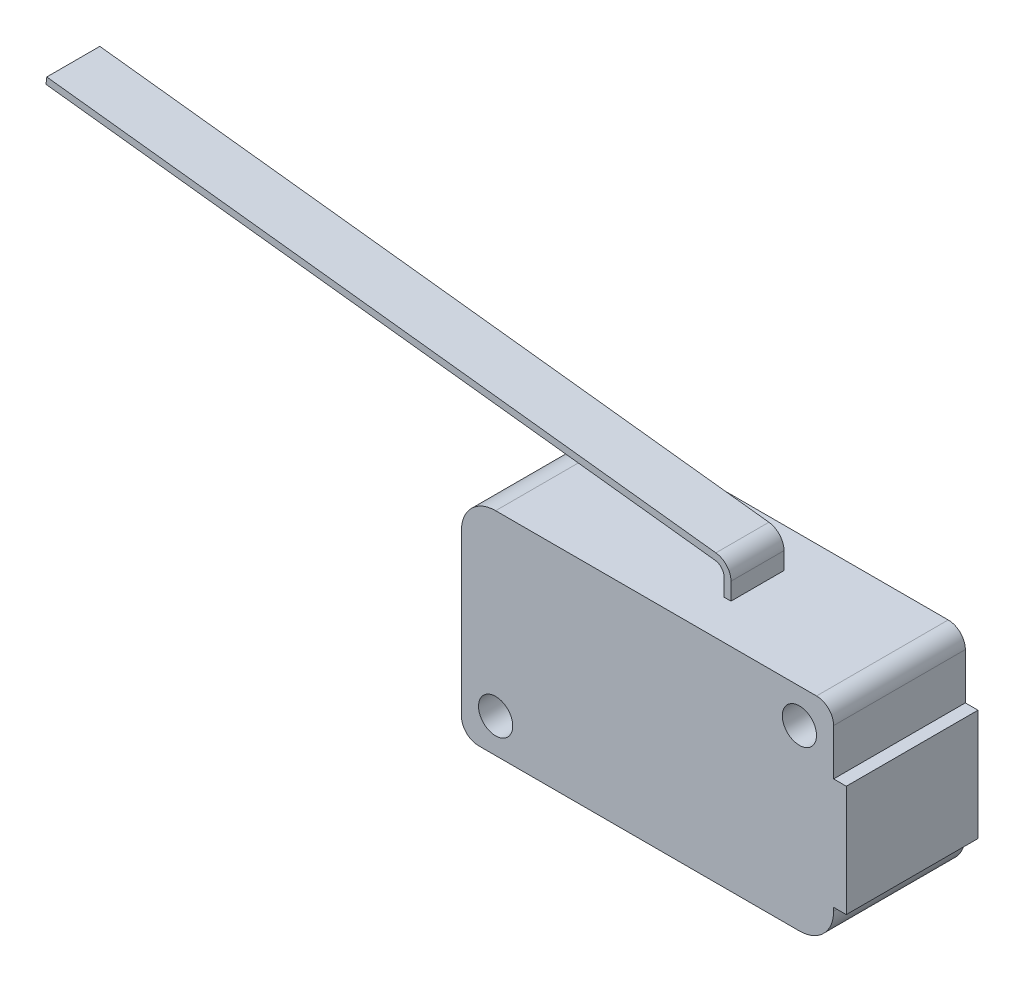
ISO-10303-21;
HEADER;
FILE_DESCRIPTION(('STEP AP214'),'2;1');
FILE_NAME('part.step','',(''),(''),'','','');
FILE_SCHEMA(('AUTOMOTIVE_DESIGN { 1 0 10303 214 1 1 1 1 }'));
ENDSEC;
DATA;
#1=APPLICATION_CONTEXT('core data for automotive mechanical design processes');
#2=APPLICATION_PROTOCOL_DEFINITION('international standard','automotive_design',2000,#1);
#3=PRODUCT_CONTEXT('',#1,'mechanical');
#4=PRODUCT('Part','Part','',(#3));
#5=PRODUCT_RELATED_PRODUCT_CATEGORY('part','',(#4));
#6=PRODUCT_DEFINITION_FORMATION('','',#4);
#7=PRODUCT_DEFINITION_CONTEXT('part definition',#1,'design');
#8=PRODUCT_DEFINITION('design','',#6,#7);
#9=PRODUCT_DEFINITION_SHAPE('','',#8);
#10=(LENGTH_UNIT() NAMED_UNIT(*) SI_UNIT(.MILLI.,.METRE.));
#11=(NAMED_UNIT(*) PLANE_ANGLE_UNIT() SI_UNIT($,.RADIAN.));
#12=(NAMED_UNIT(*) SI_UNIT($,.STERADIAN.) SOLID_ANGLE_UNIT());
#13=UNCERTAINTY_MEASURE_WITH_UNIT(LENGTH_MEASURE(1.E-05),#10,'distance_accuracy_value','');
#14=(GEOMETRIC_REPRESENTATION_CONTEXT(3) GLOBAL_UNCERTAINTY_ASSIGNED_CONTEXT((#13)) GLOBAL_UNIT_ASSIGNED_CONTEXT((#10,
#11,#12)) REPRESENTATION_CONTEXT('',''));
#15=CARTESIAN_POINT('',(0.,0.,0.));
#16=DIRECTION('',(0.,0.,1.));
#17=DIRECTION('',(1.,0.,0.));
#18=AXIS2_PLACEMENT_3D('',#15,#16,#17);
#19=CARTESIAN_POINT('',(-0.507999999999998,1.28180399212212,-1.9685));
#20=DIRECTION('',(-1.,0.,0.));
#21=DIRECTION('',(0.,-1.,0.));
#22=AXIS2_PLACEMENT_3D('',#19,#20,#21);
#23=PLANE('',#22);
#24=DIRECTION('',(0.,0.,1.));
#25=VECTOR('',#24,1.);
#26=CARTESIAN_POINT('',(-0.508,0.,-1.9685));
#27=LINE('',#26,#25);
#28=CARTESIAN_POINT('',(-0.508,0.,-1.9685));
#29=VERTEX_POINT('',#28);
#30=CARTESIAN_POINT('',(-0.507999999999999,0.,1.9685));
#31=VERTEX_POINT('',#30);
#32=EDGE_CURVE('E46',#29,#31,#27,.T.);
#33=ORIENTED_EDGE('',*,*,#32,.T.);
#34=DIRECTION('',(0.,-1.,0.));
#35=VECTOR('',#34,1.);
#36=CARTESIAN_POINT('',(-0.507999999999998,1.28180399212212,1.9685));
#37=LINE('',#36,#35);
#38=CARTESIAN_POINT('',(-0.507999999999998,1.28180399212212,1.9685));
#39=VERTEX_POINT('',#38);
#40=EDGE_CURVE('E256',#39,#31,#37,.T.);
#41=ORIENTED_EDGE('',*,*,#40,.F.);
#42=DIRECTION('',(0.,0.,1.));
#43=VECTOR('',#42,1.);
#44=CARTESIAN_POINT('',(-0.507999999999998,1.28180399212212,-1.9685));
#45=LINE('',#44,#43);
#46=CARTESIAN_POINT('',(-0.507999999999998,1.28180399212212,-1.9685));
#47=VERTEX_POINT('',#46);
#48=EDGE_CURVE('E11',#47,#39,#45,.T.);
#49=ORIENTED_EDGE('',*,*,#48,.F.);
#50=DIRECTION('',(0.,-1.,0.));
#51=VECTOR('',#50,1.);
#52=CARTESIAN_POINT('',(-0.507999999999998,1.28180399212212,-1.9685));
#53=LINE('',#52,#51);
#54=EDGE_CURVE('E192',#47,#29,#53,.T.);
#55=ORIENTED_EDGE('',*,*,#54,.T.);
#56=EDGE_LOOP('',(#33,#41,#49,#55));
#57=FACE_BOUND('',#56,.T.);
#58=ADVANCED_FACE('F43',(#57),#23,.T.);
#59=CARTESIAN_POINT('',(-1.27,1.28180399212212,-1.9685));
#60=DIRECTION('',(0.,0.,1.));
#61=DIRECTION('',(1.,0.,0.));
#62=AXIS2_PLACEMENT_3D('',#59,#60,#61);
#63=CYLINDRICAL_SURFACE('',#62,0.762);
#64=ORIENTED_EDGE('',*,*,#48,.T.);
#65=CARTESIAN_POINT('',(-1.27,1.28180399212212,1.9685));
#66=DIRECTION('',(0.,0.,1.));
#67=DIRECTION('',(1.,0.,0.));
#68=AXIS2_PLACEMENT_3D('',#65,#66,#67);
#69=CIRCLE('',#68,0.762);
#70=CARTESIAN_POINT('',(-1.18219676616617,2.03872842172412,1.9685));
#71=VERTEX_POINT('',#70);
#72=EDGE_CURVE('E260',#71,#39,#69,.F.);
#73=ORIENTED_EDGE('',*,*,#72,.F.);
#74=DIRECTION('',(0.,0.,1.));
#75=VECTOR('',#74,1.);
#76=CARTESIAN_POINT('',(-1.18219676616617,2.03872842172412,-1.9685));
#77=LINE('',#76,#75);
#78=CARTESIAN_POINT('',(-1.18219676616617,2.03872842172412,-1.9685));
#79=VERTEX_POINT('',#78);
#80=EDGE_CURVE('E52',#79,#71,#77,.T.);
#81=ORIENTED_EDGE('',*,*,#80,.F.);
#82=CARTESIAN_POINT('',(-1.27,1.28180399212212,-1.9685));
#83=DIRECTION('',(0.,0.,1.));
#84=DIRECTION('',(1.,0.,0.));
#85=AXIS2_PLACEMENT_3D('',#82,#83,#84);
#86=CIRCLE('',#85,0.762);
#87=EDGE_CURVE('E385',#79,#47,#86,.F.);
#88=ORIENTED_EDGE('',*,*,#87,.T.);
#89=EDGE_LOOP('',(#64,#73,#81,#88));
#90=FACE_BOUND('',#89,.T.);
#91=ADVANCED_FACE('F426',(#90),#63,.F.);
#92=CARTESIAN_POINT('',(-1.18219676616617,2.03872842172412,-1.9685));
#93=DIRECTION('',(-0.115227340989282,-0.993339146459325,0.));
#94=DIRECTION('',(0.993339146459325,-0.115227340989282,0.));
#95=AXIS2_PLACEMENT_3D('',#92,#93,#94);
#96=PLANE('',#95);
#97=ORIENTED_EDGE('',*,*,#80,.T.);
#98=DIRECTION('',(0.993339146459325,-0.115227340989282,0.));
#99=VECTOR('',#98,1.);
#100=CARTESIAN_POINT('',(-1.18219676616617,2.03872842172412,1.9685));
#101=LINE('',#100,#99);
#102=CARTESIAN_POINT('',(-50.8585354892226,7.80118371359866,1.9685));
#103=VERTEX_POINT('',#102);
#104=EDGE_CURVE('E264',#103,#71,#101,.T.);
#105=ORIENTED_EDGE('',*,*,#104,.F.);
#106=DIRECTION('',(0.,0.,1.));
#107=VECTOR('',#106,1.);
#108=CARTESIAN_POINT('',(-50.8585354892226,7.80118371359866,-1.9685));
#109=LINE('',#108,#107);
#110=CARTESIAN_POINT('',(-50.8585354892226,7.80118371359866,-1.9685));
#111=VERTEX_POINT('',#110);
#112=EDGE_CURVE('E390',#111,#103,#109,.T.);
#113=ORIENTED_EDGE('',*,*,#112,.F.);
#114=DIRECTION('',(0.993339146459325,-0.115227340989282,0.));
#115=VECTOR('',#114,1.);
#116=CARTESIAN_POINT('',(-1.18219676616617,2.03872842172412,-1.9685));
#117=LINE('',#116,#115);
#118=EDGE_CURVE('E382',#111,#79,#117,.T.);
#119=ORIENTED_EDGE('',*,*,#118,.T.);
#120=EDGE_LOOP('',(#97,#105,#113,#119));
#121=FACE_BOUND('',#120,.T.);
#122=ADVANCED_FACE('F430',(#121),#96,.T.);
#123=CARTESIAN_POINT('',(-50.8585354892226,7.80118371359866,-1.9685));
#124=DIRECTION('',(0.993339146459324,-0.115227340989285,0.));
#125=DIRECTION('',(0.115227340989285,0.993339146459324,0.));
#126=AXIS2_PLACEMENT_3D('',#123,#124,#125);
#127=PLANE('',#126);
#128=ORIENTED_EDGE('',*,*,#112,.T.);
#129=DIRECTION('',(0.115227340989285,0.993339146459325,0.));
#130=VECTOR('',#129,1.);
#131=CARTESIAN_POINT('',(-50.8585354892226,7.80118371359866,1.9685));
#132=LINE('',#131,#130);
#133=CARTESIAN_POINT('',(-50.8,8.3058,1.9685));
#134=VERTEX_POINT('',#133);
#135=EDGE_CURVE('E268',#103,#134,#132,.T.);
#136=ORIENTED_EDGE('',*,*,#135,.T.);
#137=DIRECTION('',(0.,0.,1.));
#138=VECTOR('',#137,1.);
#139=CARTESIAN_POINT('',(-50.8,8.3058,-1.9685));
#140=LINE('',#139,#138);
#141=CARTESIAN_POINT('',(-50.8,8.3058,-1.9685));
#142=VERTEX_POINT('',#141);
#143=EDGE_CURVE('E393',#142,#134,#140,.T.);
#144=ORIENTED_EDGE('',*,*,#143,.F.);
#145=DIRECTION('',(0.115227340989285,0.993339146459325,0.));
#146=VECTOR('',#145,1.);
#147=CARTESIAN_POINT('',(-50.8585354892226,7.80118371359866,-1.9685));
#148=LINE('',#147,#146);
#149=EDGE_CURVE('E379',#111,#142,#148,.T.);
#150=ORIENTED_EDGE('',*,*,#149,.F.);
#151=EDGE_LOOP('',(#128,#136,#144,#150));
#152=FACE_BOUND('',#151,.T.);
#153=ADVANCED_FACE('F435',(#152),#127,.F.);
#154=CARTESIAN_POINT('',(-1.12366127694361,2.54334470812546,-1.9685));
#155=DIRECTION('',(-0.115227340989282,-0.993339146459325,0.));
#156=DIRECTION('',(0.993339146459325,-0.115227340989282,0.));
#157=AXIS2_PLACEMENT_3D('',#154,#155,#156);
#158=PLANE('',#157);
#159=ORIENTED_EDGE('',*,*,#143,.T.);
#160=DIRECTION('',(0.993339146459325,-0.115227340989282,0.));
#161=VECTOR('',#160,1.);
#162=CARTESIAN_POINT('',(-1.12366127694361,2.54334470812546,1.9685));
#163=LINE('',#162,#161);
#164=CARTESIAN_POINT('',(-1.12366127694361,2.54334470812546,1.9685));
#165=VERTEX_POINT('',#164);
#166=EDGE_CURVE('E272',#134,#165,#163,.T.);
#167=ORIENTED_EDGE('',*,*,#166,.T.);
#168=DIRECTION('',(0.,0.,1.));
#169=VECTOR('',#168,1.);
#170=CARTESIAN_POINT('',(-1.12366127694361,2.54334470812546,-1.9685));
#171=LINE('',#170,#169);
#172=CARTESIAN_POINT('',(-1.12366127694361,2.54334470812546,-1.9685));
#173=VERTEX_POINT('',#172);
#174=EDGE_CURVE('E396',#173,#165,#171,.T.);
#175=ORIENTED_EDGE('',*,*,#174,.F.);
#176=DIRECTION('',(0.993339146459325,-0.115227340989282,0.));
#177=VECTOR('',#176,1.);
#178=CARTESIAN_POINT('',(-1.12366127694361,2.54334470812546,-1.9685));
#179=LINE('',#178,#177);
#180=EDGE_CURVE('E376',#142,#173,#179,.T.);
#181=ORIENTED_EDGE('',*,*,#180,.F.);
#182=EDGE_LOOP('',(#159,#167,#175,#181));
#183=FACE_BOUND('',#182,.T.);
#184=ADVANCED_FACE('F443',(#183),#158,.F.);
#185=CARTESIAN_POINT('',(-1.27,1.28180399212212,-1.9685));
#186=DIRECTION('',(0.,0.,1.));
#187=DIRECTION('',(1.,0.,0.));
#188=AXIS2_PLACEMENT_3D('',#185,#186,#187);
#189=CYLINDRICAL_SURFACE('',#188,1.27);
#190=ORIENTED_EDGE('',*,*,#174,.T.);
#191=CARTESIAN_POINT('',(-1.27,1.28180399212212,1.9685));
#192=DIRECTION('',(0.,0.,-1.));
#193=DIRECTION('',(-1.,0.,0.));
#194=AXIS2_PLACEMENT_3D('',#191,#192,#193);
#195=CIRCLE('',#194,1.27);
#196=CARTESIAN_POINT('',(0.,1.28180399212212,1.9685));
#197=VERTEX_POINT('',#196);
#198=EDGE_CURVE('E276',#165,#197,#195,.T.);
#199=ORIENTED_EDGE('',*,*,#198,.T.);
#200=DIRECTION('',(0.,0.,1.));
#201=VECTOR('',#200,1.);
#202=CARTESIAN_POINT('',(0.,1.28180399212212,-1.9685));
#203=LINE('',#202,#201);
#204=CARTESIAN_POINT('',(0.,1.28180399212212,-1.9685));
#205=VERTEX_POINT('',#204);
#206=EDGE_CURVE('E399',#205,#197,#203,.T.);
#207=ORIENTED_EDGE('',*,*,#206,.F.);
#208=CARTESIAN_POINT('',(-1.27,1.28180399212212,-1.9685));
#209=DIRECTION('',(0.,0.,-1.));
#210=DIRECTION('',(-1.,0.,0.));
#211=AXIS2_PLACEMENT_3D('',#208,#209,#210);
#212=CIRCLE('',#211,1.27);
#213=EDGE_CURVE('E373',#173,#205,#212,.T.);
#214=ORIENTED_EDGE('',*,*,#213,.F.);
#215=EDGE_LOOP('',(#190,#199,#207,#214));
#216=FACE_BOUND('',#215,.T.);
#217=ADVANCED_FACE('F447',(#216),#189,.T.);
#218=CARTESIAN_POINT('',(0.,1.28180399212212,-1.9685));
#219=DIRECTION('',(-1.,0.,0.));
#220=DIRECTION('',(0.,-1.,0.));
#221=AXIS2_PLACEMENT_3D('',#218,#219,#220);
#222=PLANE('',#221);
#223=ORIENTED_EDGE('',*,*,#206,.T.);
#224=DIRECTION('',(0.,-1.,0.));
#225=VECTOR('',#224,1.);
#226=CARTESIAN_POINT('',(0.,1.28180399212212,1.9685));
#227=LINE('',#226,#225);
#228=CARTESIAN_POINT('',(0.,0.,1.9685));
#229=VERTEX_POINT('',#228);
#230=EDGE_CURVE('E280',#197,#229,#227,.T.);
#231=ORIENTED_EDGE('',*,*,#230,.T.);
#232=DIRECTION('',(0.,0.,1.));
#233=VECTOR('',#232,1.);
#234=CARTESIAN_POINT('',(0.,0.,-1.9685));
#235=LINE('',#234,#233);
#236=CARTESIAN_POINT('',(0.,0.,-1.9685));
#237=VERTEX_POINT('',#236);
#238=EDGE_CURVE('E401',#237,#229,#235,.T.);
#239=ORIENTED_EDGE('',*,*,#238,.F.);
#240=DIRECTION('',(0.,-1.,0.));
#241=VECTOR('',#240,1.);
#242=CARTESIAN_POINT('',(0.,1.28180399212212,-1.9685));
#243=LINE('',#242,#241);
#244=EDGE_CURVE('E370',#205,#237,#243,.T.);
#245=ORIENTED_EDGE('',*,*,#244,.F.);
#246=EDGE_LOOP('',(#223,#231,#239,#245));
#247=FACE_BOUND('',#246,.T.);
#248=ADVANCED_FACE('F450',(#247),#222,.F.);
#249=CARTESIAN_POINT('',(-1.27,1.28180399212212,-1.9685));
#250=DIRECTION('',(0.,0.,-1.));
#251=DIRECTION('',(-1.,0.,0.));
#252=AXIS2_PLACEMENT_3D('',#249,#250,#251);
#253=PLANE('',#252);
#254=ORIENTED_EDGE('',*,*,#54,.F.);
#255=ORIENTED_EDGE('',*,*,#87,.F.);
#256=ORIENTED_EDGE('',*,*,#118,.F.);
#257=ORIENTED_EDGE('',*,*,#149,.T.);
#258=ORIENTED_EDGE('',*,*,#180,.T.);
#259=ORIENTED_EDGE('',*,*,#213,.T.);
#260=ORIENTED_EDGE('',*,*,#244,.T.);
#261=DIRECTION('',(-1.,0.,0.));
#262=VECTOR('',#261,1.);
#263=CARTESIAN_POINT('',(0.,0.,-1.9685));
#264=LINE('',#263,#262);
#265=EDGE_CURVE('E367',#237,#29,#264,.T.);
#266=ORIENTED_EDGE('',*,*,#265,.T.);
#267=EDGE_LOOP('',(#254,#255,#256,#257,#258,#259,#260,#266));
#268=FACE_BOUND('',#267,.T.);
#269=ADVANCED_FACE('F422',(#268),#253,.T.);
#270=CARTESIAN_POINT('',(-14.5542,-2.54,-4.8895));
#271=DIRECTION('',(0.,0.,1.));
#272=DIRECTION('',(1.,0.,0.));
#273=AXIS2_PLACEMENT_3D('',#270,#271,#272);
#274=CYLINDRICAL_SURFACE('',#273,2.54);
#275=DIRECTION('',(0.,0.,1.));
#276=VECTOR('',#275,1.);
#277=CARTESIAN_POINT('',(-17.0942,-2.54,-4.8895));
#278=LINE('',#277,#276);
#279=CARTESIAN_POINT('',(-17.0942,-2.54,-4.8895));
#280=VERTEX_POINT('',#279);
#281=CARTESIAN_POINT('',(-17.0942,-2.54,4.8895));
#282=VERTEX_POINT('',#281);
#283=EDGE_CURVE('E209',#280,#282,#278,.T.);
#284=ORIENTED_EDGE('',*,*,#283,.T.);
#285=CARTESIAN_POINT('',(-14.5542,-2.54,4.8895));
#286=DIRECTION('',(0.,0.,1.));
#287=DIRECTION('',(1.,0.,0.));
#288=AXIS2_PLACEMENT_3D('',#285,#286,#287);
#289=CIRCLE('',#288,2.54);
#290=CARTESIAN_POINT('',(-14.5542,0.,4.8895));
#291=VERTEX_POINT('',#290);
#292=EDGE_CURVE('E200',#282,#291,#289,.F.);
#293=ORIENTED_EDGE('',*,*,#292,.T.);
#294=DIRECTION('',(0.,0.,1.));
#295=VECTOR('',#294,1.);
#296=CARTESIAN_POINT('',(-14.5542,0.,-4.8895));
#297=LINE('',#296,#295);
#298=CARTESIAN_POINT('',(-14.5542,0.,-4.8895));
#299=VERTEX_POINT('',#298);
#300=EDGE_CURVE('E181',#299,#291,#297,.T.);
#301=ORIENTED_EDGE('',*,*,#300,.F.);
#302=CARTESIAN_POINT('',(-14.5542,-2.54,-4.8895));
#303=DIRECTION('',(0.,0.,1.));
#304=DIRECTION('',(1.,0.,0.));
#305=AXIS2_PLACEMENT_3D('',#302,#303,#304);
#306=CIRCLE('',#305,2.54);
#307=EDGE_CURVE('E296',#280,#299,#306,.F.);
#308=ORIENTED_EDGE('',*,*,#307,.F.);
#309=EDGE_LOOP('',(#284,#293,#301,#308));
#310=FACE_BOUND('',#309,.T.);
#311=ADVANCED_FACE('F207',(#310),#274,.T.);
#312=CARTESIAN_POINT('',(0.,0.,-4.8895));
#313=DIRECTION('',(0.,-1.,0.));
#314=DIRECTION('',(0.,0.,-1.));
#315=AXIS2_PLACEMENT_3D('',#312,#313,#314);
#316=PLANE('',#315);
#317=DIRECTION('',(-1.,0.,0.));
#318=VECTOR('',#317,1.);
#319=CARTESIAN_POINT('',(0.,0.,1.9685));
#320=LINE('',#319,#318);
#321=EDGE_CURVE('E284',#229,#31,#320,.T.);
#322=ORIENTED_EDGE('',*,*,#321,.T.);
#323=ORIENTED_EDGE('',*,*,#32,.F.);
#324=ORIENTED_EDGE('',*,*,#265,.F.);
#325=ORIENTED_EDGE('',*,*,#238,.T.);
#326=EDGE_LOOP('',(#322,#323,#324,#325));
#327=FACE_BOUND('',#326,.T.);
#328=ORIENTED_EDGE('',*,*,#300,.T.);
#329=DIRECTION('',(1.,0.,0.));
#330=VECTOR('',#329,1.);
#331=CARTESIAN_POINT('',(0.,0.,4.8895));
#332=LINE('',#331,#330);
#333=CARTESIAN_POINT('',(9.271,0.,4.8895));
#334=VERTEX_POINT('',#333);
#335=EDGE_CURVE('E185',#291,#334,#332,.T.);
#336=ORIENTED_EDGE('',*,*,#335,.T.);
#337=DIRECTION('',(0.,0.,1.));
#338=VECTOR('',#337,1.);
#339=CARTESIAN_POINT('',(9.271,0.,-4.8895));
#340=LINE('',#339,#338);
#341=CARTESIAN_POINT('',(9.271,0.,-4.8895));
#342=VERTEX_POINT('',#341);
#343=EDGE_CURVE('E193',#342,#334,#340,.T.);
#344=ORIENTED_EDGE('',*,*,#343,.F.);
#345=DIRECTION('',(1.,0.,0.));
#346=VECTOR('',#345,1.);
#347=CARTESIAN_POINT('',(0.,0.,-4.8895));
#348=LINE('',#347,#346);
#349=EDGE_CURVE('E186',#299,#342,#348,.T.);
#350=ORIENTED_EDGE('',*,*,#349,.F.);
#351=EDGE_LOOP('',(#328,#336,#344,#350));
#352=FACE_BOUND('',#351,.T.);
#353=ADVANCED_FACE('F183',(#327,#352),#316,.F.);
#354=CARTESIAN_POINT('',(9.271,-1.27,-4.8895));
#355=DIRECTION('',(0.,0.,1.));
#356=DIRECTION('',(1.,0.,0.));
#357=AXIS2_PLACEMENT_3D('',#354,#355,#356);
#358=CYLINDRICAL_SURFACE('',#357,1.27);
#359=ORIENTED_EDGE('',*,*,#343,.T.);
#360=CARTESIAN_POINT('',(9.271,-1.27,4.8895));
#361=DIRECTION('',(0.,0.,1.));
#362=DIRECTION('',(1.,0.,0.));
#363=AXIS2_PLACEMENT_3D('',#360,#361,#362);
#364=CIRCLE('',#363,1.27);
#365=CARTESIAN_POINT('',(10.541,-1.27,4.8895));
#366=VERTEX_POINT('',#365);
#367=EDGE_CURVE('E204',#366,#334,#364,.T.);
#368=ORIENTED_EDGE('',*,*,#367,.F.);
#369=DIRECTION('',(0.,0.,1.));
#370=VECTOR('',#369,1.);
#371=CARTESIAN_POINT('',(10.541,-1.27,-4.8895));
#372=LINE('',#371,#370);
#373=CARTESIAN_POINT('',(10.541,-1.27,-4.8895));
#374=VERTEX_POINT('',#373);
#375=EDGE_CURVE('E336',#374,#366,#372,.T.);
#376=ORIENTED_EDGE('',*,*,#375,.F.);
#377=CARTESIAN_POINT('',(9.271,-1.27,-4.8895));
#378=DIRECTION('',(0.,0.,1.));
#379=DIRECTION('',(1.,0.,0.));
#380=AXIS2_PLACEMENT_3D('',#377,#378,#379);
#381=CIRCLE('',#380,1.27);
#382=EDGE_CURVE('E328',#374,#342,#381,.T.);
#383=ORIENTED_EDGE('',*,*,#382,.T.);
#384=EDGE_LOOP('',(#359,#368,#376,#383));
#385=FACE_BOUND('',#384,.T.);
#386=ADVANCED_FACE('F413',(#385),#358,.T.);
#387=CARTESIAN_POINT('',(10.541,0.,-4.8895));
#388=DIRECTION('',(-1.,0.,0.));
#389=DIRECTION('',(0.,-1.,0.));
#390=AXIS2_PLACEMENT_3D('',#387,#388,#389);
#391=PLANE('',#390);
#392=ORIENTED_EDGE('',*,*,#375,.T.);
#393=DIRECTION('',(0.,-1.,0.));
#394=VECTOR('',#393,1.);
#395=CARTESIAN_POINT('',(10.541,0.,4.8895));
#396=LINE('',#395,#394);
#397=CARTESIAN_POINT('',(10.541,-4.699,4.8895));
#398=VERTEX_POINT('',#397);
#399=EDGE_CURVE('E221',#366,#398,#396,.T.);
#400=ORIENTED_EDGE('',*,*,#399,.T.);
#401=DIRECTION('',(0.,0.,1.));
#402=VECTOR('',#401,1.);
#403=CARTESIAN_POINT('',(10.541,-4.699,-4.8895));
#404=LINE('',#403,#402);
#405=CARTESIAN_POINT('',(10.541,-4.699,-4.8895));
#406=VERTEX_POINT('',#405);
#407=EDGE_CURVE('E339',#406,#398,#404,.T.);
#408=ORIENTED_EDGE('',*,*,#407,.F.);
#409=DIRECTION('',(0.,-1.,0.));
#410=VECTOR('',#409,1.);
#411=CARTESIAN_POINT('',(10.541,0.,-4.8895));
#412=LINE('',#411,#410);
#413=EDGE_CURVE('E325',#374,#406,#412,.T.);
#414=ORIENTED_EDGE('',*,*,#413,.F.);
#415=EDGE_LOOP('',(#392,#400,#408,#414));
#416=FACE_BOUND('',#415,.T.);
#417=ADVANCED_FACE('F419',(#416),#391,.F.);
#418=CARTESIAN_POINT('',(0.,-4.699,-4.8895));
#419=DIRECTION('',(0.,1.,0.));
#420=DIRECTION('',(0.,0.,1.));
#421=AXIS2_PLACEMENT_3D('',#418,#419,#420);
#422=PLANE('',#421);
#423=ORIENTED_EDGE('',*,*,#407,.T.);
#424=DIRECTION('',(-1.,0.,0.));
#425=VECTOR('',#424,1.);
#426=CARTESIAN_POINT('',(0.,-4.699,4.8895));
#427=LINE('',#426,#425);
#428=CARTESIAN_POINT('',(11.4808,-4.699,4.8895));
#429=VERTEX_POINT('',#428);
#430=EDGE_CURVE('E225',#429,#398,#427,.T.);
#431=ORIENTED_EDGE('',*,*,#430,.F.);
#432=DIRECTION('',(0.,0.,1.));
#433=VECTOR('',#432,1.);
#434=CARTESIAN_POINT('',(11.4808,-4.699,-4.8895));
#435=LINE('',#434,#433);
#436=CARTESIAN_POINT('',(11.4808,-4.699,-4.8895));
#437=VERTEX_POINT('',#436);
#438=EDGE_CURVE('E342',#437,#429,#435,.T.);
#439=ORIENTED_EDGE('',*,*,#438,.F.);
#440=DIRECTION('',(-1.,0.,0.));
#441=VECTOR('',#440,1.);
#442=CARTESIAN_POINT('',(0.,-4.699,-4.8895));
#443=LINE('',#442,#441);
#444=EDGE_CURVE('E321',#437,#406,#443,.T.);
#445=ORIENTED_EDGE('',*,*,#444,.T.);
#446=EDGE_LOOP('',(#423,#431,#439,#445));
#447=FACE_BOUND('',#446,.T.);
#448=ADVANCED_FACE('F504',(#447),#422,.T.);
#449=CARTESIAN_POINT('',(11.4808,0.,-4.8895));
#450=DIRECTION('',(-1.,0.,0.));
#451=DIRECTION('',(0.,0.,1.));
#452=AXIS2_PLACEMENT_3D('',#449,#450,#451);
#453=PLANE('',#452);
#454=ORIENTED_EDGE('',*,*,#438,.T.);
#455=DIRECTION('',(0.,-1.,0.));
#456=VECTOR('',#455,1.);
#457=CARTESIAN_POINT('',(11.4808,0.,4.8895));
#458=LINE('',#457,#456);
#459=CARTESIAN_POINT('',(11.4808,-12.954,4.8895));
#460=VERTEX_POINT('',#459);
#461=EDGE_CURVE('E229',#429,#460,#458,.T.);
#462=ORIENTED_EDGE('',*,*,#461,.T.);
#463=DIRECTION('',(0.,0.,1.));
#464=VECTOR('',#463,1.);
#465=CARTESIAN_POINT('',(11.4808,-12.954,-4.8895));
#466=LINE('',#465,#464);
#467=CARTESIAN_POINT('',(11.4808,-12.954,-4.8895));
#468=VERTEX_POINT('',#467);
#469=EDGE_CURVE('E345',#468,#460,#466,.T.);
#470=ORIENTED_EDGE('',*,*,#469,.F.);
#471=DIRECTION('',(0.,-1.,0.));
#472=VECTOR('',#471,1.);
#473=CARTESIAN_POINT('',(11.4808,0.,-4.8895));
#474=LINE('',#473,#472);
#475=EDGE_CURVE('E318',#437,#468,#474,.T.);
#476=ORIENTED_EDGE('',*,*,#475,.F.);
#477=EDGE_LOOP('',(#454,#462,#470,#476));
#478=FACE_BOUND('',#477,.T.);
#479=ADVANCED_FACE('F515',(#478),#453,.F.);
#480=CARTESIAN_POINT('',(0.,-12.954,-4.8895));
#481=DIRECTION('',(0.,1.,0.));
#482=DIRECTION('',(0.,0.,1.));
#483=AXIS2_PLACEMENT_3D('',#480,#481,#482);
#484=PLANE('',#483);
#485=ORIENTED_EDGE('',*,*,#469,.T.);
#486=DIRECTION('',(-1.,0.,0.));
#487=VECTOR('',#486,1.);
#488=CARTESIAN_POINT('',(0.,-12.954,4.8895));
#489=LINE('',#488,#487);
#490=CARTESIAN_POINT('',(10.541,-12.954,4.8895));
#491=VERTEX_POINT('',#490);
#492=EDGE_CURVE('E233',#460,#491,#489,.T.);
#493=ORIENTED_EDGE('',*,*,#492,.T.);
#494=DIRECTION('',(0.,0.,1.));
#495=VECTOR('',#494,1.);
#496=CARTESIAN_POINT('',(10.541,-12.954,-4.8895));
#497=LINE('',#496,#495);
#498=CARTESIAN_POINT('',(10.541,-12.954,-4.8895));
#499=VERTEX_POINT('',#498);
#500=EDGE_CURVE('E348',#499,#491,#497,.T.);
#501=ORIENTED_EDGE('',*,*,#500,.F.);
#502=DIRECTION('',(-1.,0.,0.));
#503=VECTOR('',#502,1.);
#504=CARTESIAN_POINT('',(0.,-12.954,-4.8895));
#505=LINE('',#504,#503);
#506=EDGE_CURVE('E315',#468,#499,#505,.T.);
#507=ORIENTED_EDGE('',*,*,#506,.F.);
#508=EDGE_LOOP('',(#485,#493,#501,#507));
#509=FACE_BOUND('',#508,.T.);
#510=ADVANCED_FACE('F526',(#509),#484,.F.);
#511=CARTESIAN_POINT('',(10.541,0.,-4.8895));
#512=DIRECTION('',(-1.,0.,0.));
#513=DIRECTION('',(0.,0.,1.));
#514=AXIS2_PLACEMENT_3D('',#511,#512,#513);
#515=PLANE('',#514);
#516=ORIENTED_EDGE('',*,*,#500,.T.);
#517=DIRECTION('',(0.,-1.,0.));
#518=VECTOR('',#517,1.);
#519=CARTESIAN_POINT('',(10.541,0.,4.8895));
#520=LINE('',#519,#518);
#521=CARTESIAN_POINT('',(10.541,-13.208,4.8895));
#522=VERTEX_POINT('',#521);
#523=EDGE_CURVE('E237',#491,#522,#520,.T.);
#524=ORIENTED_EDGE('',*,*,#523,.T.);
#525=DIRECTION('',(0.,0.,1.));
#526=VECTOR('',#525,1.);
#527=CARTESIAN_POINT('',(10.541,-13.208,-4.8895));
#528=LINE('',#527,#526);
#529=CARTESIAN_POINT('',(10.541,-13.208,-4.8895));
#530=VERTEX_POINT('',#529);
#531=EDGE_CURVE('E351',#530,#522,#528,.T.);
#532=ORIENTED_EDGE('',*,*,#531,.F.);
#533=DIRECTION('',(0.,-1.,0.));
#534=VECTOR('',#533,1.);
#535=CARTESIAN_POINT('',(10.541,0.,-4.8895));
#536=LINE('',#535,#534);
#537=EDGE_CURVE('E312',#499,#530,#536,.T.);
#538=ORIENTED_EDGE('',*,*,#537,.F.);
#539=EDGE_LOOP('',(#516,#524,#532,#538));
#540=FACE_BOUND('',#539,.T.);
#541=ADVANCED_FACE('F537',(#540),#515,.F.);
#542=CARTESIAN_POINT('',(8.001,-13.208,-4.8895));
#543=DIRECTION('',(0.,0.,1.));
#544=DIRECTION('',(1.,0.,0.));
#545=AXIS2_PLACEMENT_3D('',#542,#543,#544);
#546=CYLINDRICAL_SURFACE('',#545,2.54);
#547=ORIENTED_EDGE('',*,*,#531,.T.);
#548=CARTESIAN_POINT('',(8.001,-13.208,4.8895));
#549=DIRECTION('',(0.,0.,1.));
#550=DIRECTION('',(1.,0.,0.));
#551=AXIS2_PLACEMENT_3D('',#548,#549,#550);
#552=CIRCLE('',#551,2.54);
#553=CARTESIAN_POINT('',(8.001,-15.748,4.8895));
#554=VERTEX_POINT('',#553);
#555=EDGE_CURVE('E241',#522,#554,#552,.F.);
#556=ORIENTED_EDGE('',*,*,#555,.T.);
#557=DIRECTION('',(0.,0.,1.));
#558=VECTOR('',#557,1.);
#559=CARTESIAN_POINT('',(8.001,-15.748,-4.8895));
#560=LINE('',#559,#558);
#561=CARTESIAN_POINT('',(8.001,-15.748,-4.8895));
#562=VERTEX_POINT('',#561);
#563=EDGE_CURVE('E354',#562,#554,#560,.T.);
#564=ORIENTED_EDGE('',*,*,#563,.F.);
#565=CARTESIAN_POINT('',(8.001,-13.208,-4.8895));
#566=DIRECTION('',(0.,0.,1.));
#567=DIRECTION('',(1.,0.,0.));
#568=AXIS2_PLACEMENT_3D('',#565,#566,#567);
#569=CIRCLE('',#568,2.54);
#570=EDGE_CURVE('E309',#530,#562,#569,.F.);
#571=ORIENTED_EDGE('',*,*,#570,.F.);
#572=EDGE_LOOP('',(#547,#556,#564,#571));
#573=FACE_BOUND('',#572,.T.);
#574=ADVANCED_FACE('F548',(#573),#546,.T.);
#575=CARTESIAN_POINT('',(0.,-15.748,-4.8895));
#576=DIRECTION('',(0.,1.,0.));
#577=DIRECTION('',(0.,0.,1.));
#578=AXIS2_PLACEMENT_3D('',#575,#576,#577);
#579=PLANE('',#578);
#580=ORIENTED_EDGE('',*,*,#563,.T.);
#581=DIRECTION('',(-1.,0.,0.));
#582=VECTOR('',#581,1.);
#583=CARTESIAN_POINT('',(0.,-15.748,4.8895));
#584=LINE('',#583,#582);
#585=CARTESIAN_POINT('',(-15.8242,-15.748,4.8895));
#586=VERTEX_POINT('',#585);
#587=EDGE_CURVE('E245',#554,#586,#584,.T.);
#588=ORIENTED_EDGE('',*,*,#587,.T.);
#589=DIRECTION('',(0.,0.,1.));
#590=VECTOR('',#589,1.);
#591=CARTESIAN_POINT('',(-15.8242,-15.748,-4.8895));
#592=LINE('',#591,#590);
#593=CARTESIAN_POINT('',(-15.8242,-15.748,-4.8895));
#594=VERTEX_POINT('',#593);
#595=EDGE_CURVE('E357',#594,#586,#592,.T.);
#596=ORIENTED_EDGE('',*,*,#595,.F.);
#597=DIRECTION('',(-1.,0.,0.));
#598=VECTOR('',#597,1.);
#599=CARTESIAN_POINT('',(0.,-15.748,-4.8895));
#600=LINE('',#599,#598);
#601=EDGE_CURVE('E306',#562,#594,#600,.T.);
#602=ORIENTED_EDGE('',*,*,#601,.F.);
#603=EDGE_LOOP('',(#580,#588,#596,#602));
#604=FACE_BOUND('',#603,.T.);
#605=ADVANCED_FACE('F559',(#604),#579,.F.);
#606=CARTESIAN_POINT('',(-15.8242,-14.478,-4.8895));
#607=DIRECTION('',(0.,0.,1.));
#608=DIRECTION('',(1.,0.,0.));
#609=AXIS2_PLACEMENT_3D('',#606,#607,#608);
#610=CYLINDRICAL_SURFACE('',#609,1.27);
#611=ORIENTED_EDGE('',*,*,#595,.T.);
#612=CARTESIAN_POINT('',(-15.8242,-14.478,4.8895));
#613=DIRECTION('',(0.,0.,1.));
#614=DIRECTION('',(1.,0.,0.));
#615=AXIS2_PLACEMENT_3D('',#612,#613,#614);
#616=CIRCLE('',#615,1.27);
#617=CARTESIAN_POINT('',(-17.0942,-14.478,4.8895));
#618=VERTEX_POINT('',#617);
#619=EDGE_CURVE('E249',#618,#586,#616,.T.);
#620=ORIENTED_EDGE('',*,*,#619,.F.);
#621=DIRECTION('',(0.,0.,1.));
#622=VECTOR('',#621,1.);
#623=CARTESIAN_POINT('',(-17.0942,-14.478,-4.8895));
#624=LINE('',#623,#622);
#625=CARTESIAN_POINT('',(-17.0942,-14.478,-4.8895));
#626=VERTEX_POINT('',#625);
#627=EDGE_CURVE('E360',#626,#618,#624,.T.);
#628=ORIENTED_EDGE('',*,*,#627,.F.);
#629=CARTESIAN_POINT('',(-15.8242,-14.478,-4.8895));
#630=DIRECTION('',(0.,0.,1.));
#631=DIRECTION('',(1.,0.,0.));
#632=AXIS2_PLACEMENT_3D('',#629,#630,#631);
#633=CIRCLE('',#632,1.27);
#634=EDGE_CURVE('E302',#626,#594,#633,.T.);
#635=ORIENTED_EDGE('',*,*,#634,.T.);
#636=EDGE_LOOP('',(#611,#620,#628,#635));
#637=FACE_BOUND('',#636,.T.);
#638=ADVANCED_FACE('F570',(#637),#610,.T.);
#639=CARTESIAN_POINT('',(8.001,-2.54,-4.8895));
#640=DIRECTION('',(0.,0.,1.));
#641=DIRECTION('',(1.,0.,0.));
#642=AXIS2_PLACEMENT_3D('',#639,#640,#641);
#643=CYLINDRICAL_SURFACE('',#642,1.27);
#644=CARTESIAN_POINT('',(8.001,-2.54,-4.8895));
#645=DIRECTION('',(0.,0.,1.));
#646=DIRECTION('',(1.,0.,0.));
#647=AXIS2_PLACEMENT_3D('',#644,#645,#646);
#648=CIRCLE('',#647,1.27);
#649=CARTESIAN_POINT('',(9.271,-2.54,-4.8895));
#650=VERTEX_POINT('',#649);
#651=EDGE_CURVE('E292',#650,#650,#648,.T.);
#652=ORIENTED_EDGE('',*,*,#651,.F.);
#653=EDGE_LOOP('',(#652));
#654=FACE_BOUND('',#653,.T.);
#655=CARTESIAN_POINT('',(8.001,-2.54,4.8895));
#656=DIRECTION('',(0.,0.,1.));
#657=DIRECTION('',(1.,0.,0.));
#658=AXIS2_PLACEMENT_3D('',#655,#656,#657);
#659=CIRCLE('',#658,1.27);
#660=CARTESIAN_POINT('',(9.271,-2.54,4.8895));
#661=VERTEX_POINT('',#660);
#662=EDGE_CURVE('E211',#661,#661,#659,.T.);
#663=ORIENTED_EDGE('',*,*,#662,.T.);
#664=EDGE_LOOP('',(#663));
#665=FACE_BOUND('',#664,.T.);
#666=ADVANCED_FACE('F581',(#654,#665),#643,.F.);
#667=CARTESIAN_POINT('',(-14.5542,-13.208,-4.8895));
#668=DIRECTION('',(0.,0.,1.));
#669=DIRECTION('',(1.,0.,0.));
#670=AXIS2_PLACEMENT_3D('',#667,#668,#669);
#671=CYLINDRICAL_SURFACE('',#670,1.27);
#672=CARTESIAN_POINT('',(-14.5542,-13.208,-4.8895));
#673=DIRECTION('',(0.,0.,1.));
#674=DIRECTION('',(1.,0.,0.));
#675=AXIS2_PLACEMENT_3D('',#672,#673,#674);
#676=CIRCLE('',#675,1.27);
#677=CARTESIAN_POINT('',(-13.2842,-13.208,-4.8895));
#678=VERTEX_POINT('',#677);
#679=EDGE_CURVE('E288',#678,#678,#676,.T.);
#680=ORIENTED_EDGE('',*,*,#679,.F.);
#681=EDGE_LOOP('',(#680));
#682=FACE_BOUND('',#681,.T.);
#683=CARTESIAN_POINT('',(-14.5542,-13.208,4.8895));
#684=DIRECTION('',(0.,0.,1.));
#685=DIRECTION('',(1.,0.,0.));
#686=AXIS2_PLACEMENT_3D('',#683,#684,#685);
#687=CIRCLE('',#686,1.27);
#688=CARTESIAN_POINT('',(-13.2842,-13.208,4.8895));
#689=VERTEX_POINT('',#688);
#690=EDGE_CURVE('E215',#689,#689,#687,.T.);
#691=ORIENTED_EDGE('',*,*,#690,.T.);
#692=EDGE_LOOP('',(#691));
#693=FACE_BOUND('',#692,.T.);
#694=ADVANCED_FACE('F592',(#682,#693),#671,.F.);
#695=CARTESIAN_POINT('',(-17.0942,0.,-4.8895));
#696=DIRECTION('',(1.,0.,0.));
#697=DIRECTION('',(0.,1.,0.));
#698=AXIS2_PLACEMENT_3D('',#695,#696,#697);
#699=PLANE('',#698);
#700=ORIENTED_EDGE('',*,*,#627,.T.);
#701=DIRECTION('',(0.,1.,0.));
#702=VECTOR('',#701,1.);
#703=CARTESIAN_POINT('',(-17.0942,0.,4.8895));
#704=LINE('',#703,#702);
#705=EDGE_CURVE('E253',#618,#282,#704,.T.);
#706=ORIENTED_EDGE('',*,*,#705,.T.);
#707=ORIENTED_EDGE('',*,*,#283,.F.);
#708=DIRECTION('',(0.,1.,0.));
#709=VECTOR('',#708,1.);
#710=CARTESIAN_POINT('',(-17.0942,0.,-4.8895));
#711=LINE('',#710,#709);
#712=EDGE_CURVE('E299',#626,#280,#711,.T.);
#713=ORIENTED_EDGE('',*,*,#712,.F.);
#714=EDGE_LOOP('',(#700,#706,#707,#713));
#715=FACE_BOUND('',#714,.T.);
#716=ADVANCED_FACE('F603',(#715),#699,.F.);
#717=CARTESIAN_POINT('',(0.,0.,-4.8895));
#718=DIRECTION('',(0.,0.,1.));
#719=DIRECTION('',(1.,0.,0.));
#720=AXIS2_PLACEMENT_3D('',#717,#718,#719);
#721=PLANE('',#720);
#722=ORIENTED_EDGE('',*,*,#679,.T.);
#723=EDGE_LOOP('',(#722));
#724=FACE_BOUND('',#723,.T.);
#725=ORIENTED_EDGE('',*,*,#651,.T.);
#726=EDGE_LOOP('',(#725));
#727=FACE_BOUND('',#726,.T.);
#728=ORIENTED_EDGE('',*,*,#307,.T.);
#729=ORIENTED_EDGE('',*,*,#349,.T.);
#730=ORIENTED_EDGE('',*,*,#382,.F.);
#731=ORIENTED_EDGE('',*,*,#413,.T.);
#732=ORIENTED_EDGE('',*,*,#444,.F.);
#733=ORIENTED_EDGE('',*,*,#475,.T.);
#734=ORIENTED_EDGE('',*,*,#506,.T.);
#735=ORIENTED_EDGE('',*,*,#537,.T.);
#736=ORIENTED_EDGE('',*,*,#570,.T.);
#737=ORIENTED_EDGE('',*,*,#601,.T.);
#738=ORIENTED_EDGE('',*,*,#634,.F.);
#739=ORIENTED_EDGE('',*,*,#712,.T.);
#740=EDGE_LOOP('',(#728,#729,#730,#731,#732,#733,#734,#735,#736,#737,#738,#739));
#741=FACE_BOUND('',#740,.T.);
#742=ADVANCED_FACE('F613',(#724,#727,#741),#721,.F.);
#743=CARTESIAN_POINT('',(-1.27,1.28180399212212,1.9685));
#744=DIRECTION('',(0.,0.,1.));
#745=DIRECTION('',(-1.,0.,0.));
#746=AXIS2_PLACEMENT_3D('',#743,#744,#745);
#747=PLANE('',#746);
#748=ORIENTED_EDGE('',*,*,#40,.T.);
#749=ORIENTED_EDGE('',*,*,#321,.F.);
#750=ORIENTED_EDGE('',*,*,#230,.F.);
#751=ORIENTED_EDGE('',*,*,#198,.F.);
#752=ORIENTED_EDGE('',*,*,#166,.F.);
#753=ORIENTED_EDGE('',*,*,#135,.F.);
#754=ORIENTED_EDGE('',*,*,#104,.T.);
#755=ORIENTED_EDGE('',*,*,#72,.T.);
#756=EDGE_LOOP('',(#748,#749,#750,#751,#752,#753,#754,#755));
#757=FACE_BOUND('',#756,.T.);
#758=ADVANCED_FACE('F410',(#757),#747,.T.);
#759=CARTESIAN_POINT('',(0.,0.,4.8895));
#760=DIRECTION('',(0.,0.,-1.));
#761=DIRECTION('',(1.,0.,0.));
#762=AXIS2_PLACEMENT_3D('',#759,#760,#761);
#763=PLANE('',#762);
#764=ORIENTED_EDGE('',*,*,#690,.F.);
#765=EDGE_LOOP('',(#764));
#766=FACE_BOUND('',#765,.T.);
#767=ORIENTED_EDGE('',*,*,#662,.F.);
#768=EDGE_LOOP('',(#767));
#769=FACE_BOUND('',#768,.T.);
#770=ORIENTED_EDGE('',*,*,#292,.F.);
#771=ORIENTED_EDGE('',*,*,#705,.F.);
#772=ORIENTED_EDGE('',*,*,#619,.T.);
#773=ORIENTED_EDGE('',*,*,#587,.F.);
#774=ORIENTED_EDGE('',*,*,#555,.F.);
#775=ORIENTED_EDGE('',*,*,#523,.F.);
#776=ORIENTED_EDGE('',*,*,#492,.F.);
#777=ORIENTED_EDGE('',*,*,#461,.F.);
#778=ORIENTED_EDGE('',*,*,#430,.T.);
#779=ORIENTED_EDGE('',*,*,#399,.F.);
#780=ORIENTED_EDGE('',*,*,#367,.T.);
#781=ORIENTED_EDGE('',*,*,#335,.F.);
#782=EDGE_LOOP('',(#770,#771,#772,#773,#774,#775,#776,#777,#778,#779,#780,#781));
#783=FACE_BOUND('',#782,.T.);
#784=ADVANCED_FACE('F198',(#766,#769,#783),#763,.F.);
#785=CLOSED_SHELL('',(#58,#91,#122,#153,#184,#217,#248,#269,#311,#353,#386,#417,#448,#479,#510,
#541,#574,#605,#638,#666,#694,#716,#742,#758,#784));
#786=MANIFOLD_SOLID_BREP('B2',#785);
#787=ADVANCED_BREP_SHAPE_REPRESENTATION('',(#18,#786),#14);
#788=SHAPE_DEFINITION_REPRESENTATION(#9,#787);
ENDSEC;
END-ISO-10303-21;
